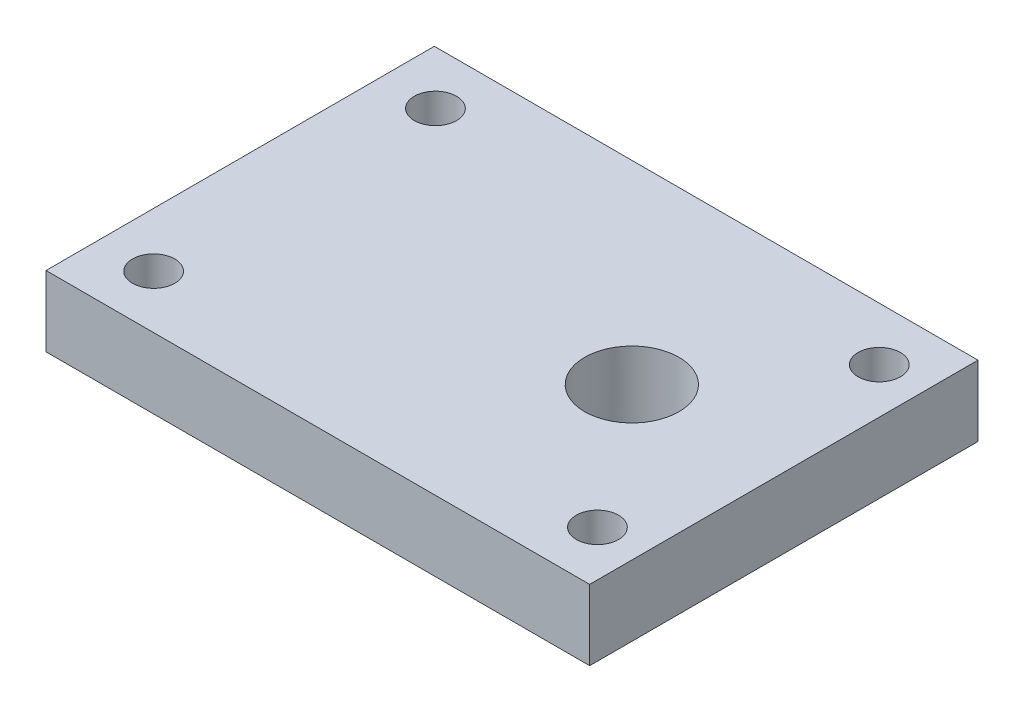
ISO-10303-21;
HEADER;
FILE_DESCRIPTION(('STEP AP214'),'2;1');
FILE_NAME('part.step','',(''),(''),'','','');
FILE_SCHEMA(('AUTOMOTIVE_DESIGN { 1 0 10303 214 1 1 1 1 }'));
ENDSEC;
DATA;
#1=APPLICATION_CONTEXT('core data for automotive mechanical design processes');
#2=APPLICATION_PROTOCOL_DEFINITION('international standard','automotive_design',2000,#1);
#3=PRODUCT_CONTEXT('',#1,'mechanical');
#4=PRODUCT('Part','Part','',(#3));
#5=PRODUCT_RELATED_PRODUCT_CATEGORY('part','',(#4));
#6=PRODUCT_DEFINITION_FORMATION('','',#4);
#7=PRODUCT_DEFINITION_CONTEXT('part definition',#1,'design');
#8=PRODUCT_DEFINITION('design','',#6,#7);
#9=PRODUCT_DEFINITION_SHAPE('','',#8);
#10=(LENGTH_UNIT() NAMED_UNIT(*) SI_UNIT(.MILLI.,.METRE.));
#11=(NAMED_UNIT(*) PLANE_ANGLE_UNIT() SI_UNIT($,.RADIAN.));
#12=(NAMED_UNIT(*) SI_UNIT($,.STERADIAN.) SOLID_ANGLE_UNIT());
#13=UNCERTAINTY_MEASURE_WITH_UNIT(LENGTH_MEASURE(1.E-05),#10,'distance_accuracy_value','');
#14=(GEOMETRIC_REPRESENTATION_CONTEXT(3) GLOBAL_UNCERTAINTY_ASSIGNED_CONTEXT((#13)) GLOBAL_UNIT_ASSIGNED_CONTEXT((#10,
#11,#12)) REPRESENTATION_CONTEXT('',''));
#15=CARTESIAN_POINT('',(0.,0.,0.));
#16=DIRECTION('',(0.,0.,1.));
#17=DIRECTION('',(1.,0.,0.));
#18=AXIS2_PLACEMENT_3D('',#15,#16,#17);
#19=CARTESIAN_POINT('',(0.,6.35,0.));
#20=DIRECTION('',(0.,-1.,0.));
#21=DIRECTION('',(0.,0.,-1.));
#22=AXIS2_PLACEMENT_3D('',#19,#20,#21);
#23=PLANE('',#22);
#24=CARTESIAN_POINT('',(10.8,6.35,0.));
#25=DIRECTION('',(0.,1.,0.));
#26=DIRECTION('',(0.,0.,1.));
#27=AXIS2_PLACEMENT_3D('',#24,#25,#26);
#28=CIRCLE('',#27,4.25);
#29=CARTESIAN_POINT('',(10.8,6.35,4.25));
#30=VERTEX_POINT('',#29);
#31=EDGE_CURVE('E168',#30,#30,#28,.T.);
#32=ORIENTED_EDGE('',*,*,#31,.F.);
#33=EDGE_LOOP('',(#32));
#34=FACE_BOUND('',#33,.T.);
#35=DIRECTION('',(0.,0.,-1.));
#36=VECTOR('',#35,1.);
#37=CARTESIAN_POINT('',(24.5,6.35,17.5));
#38=LINE('',#37,#36);
#39=CARTESIAN_POINT('',(24.5,6.35,17.5));
#40=VERTEX_POINT('',#39);
#41=CARTESIAN_POINT('',(24.5,6.35,-17.5));
#42=VERTEX_POINT('',#41);
#43=EDGE_CURVE('E95',#40,#42,#38,.T.);
#44=ORIENTED_EDGE('',*,*,#43,.T.);
#45=DIRECTION('',(-1.,0.,0.));
#46=VECTOR('',#45,1.);
#47=CARTESIAN_POINT('',(-24.5,6.35,-17.5));
#48=LINE('',#47,#46);
#49=CARTESIAN_POINT('',(-24.5,6.35,-17.5));
#50=VERTEX_POINT('',#49);
#51=EDGE_CURVE('E90',#42,#50,#48,.T.);
#52=ORIENTED_EDGE('',*,*,#51,.T.);
#53=DIRECTION('',(0.,0.,1.));
#54=VECTOR('',#53,1.);
#55=CARTESIAN_POINT('',(-24.5,6.35,17.5));
#56=LINE('',#55,#54);
#57=CARTESIAN_POINT('',(-24.5,6.35,17.5));
#58=VERTEX_POINT('',#57);
#59=EDGE_CURVE('E93',#50,#58,#56,.T.);
#60=ORIENTED_EDGE('',*,*,#59,.T.);
#61=DIRECTION('',(1.,0.,0.));
#62=VECTOR('',#61,1.);
#63=CARTESIAN_POINT('',(-24.5,6.35,17.5));
#64=LINE('',#63,#62);
#65=EDGE_CURVE('E60',#58,#40,#64,.T.);
#66=ORIENTED_EDGE('',*,*,#65,.T.);
#67=EDGE_LOOP('',(#44,#52,#60,#66));
#68=FACE_BOUND('',#67,.T.);
#69=CARTESIAN_POINT('',(-19.6,6.35,-12.7));
#70=DIRECTION('',(0.,1.,0.));
#71=DIRECTION('',(0.,0.,1.));
#72=AXIS2_PLACEMENT_3D('',#69,#70,#71);
#73=CIRCLE('',#72,1.90500000000001);
#74=CARTESIAN_POINT('',(-19.6,6.35,-10.795));
#75=VERTEX_POINT('',#74);
#76=EDGE_CURVE('E115',#75,#75,#73,.T.);
#77=ORIENTED_EDGE('',*,*,#76,.F.);
#78=EDGE_LOOP('',(#77));
#79=FACE_BOUND('',#78,.T.);
#80=CARTESIAN_POINT('',(20.4,6.35,-12.7));
#81=DIRECTION('',(0.,1.,0.));
#82=DIRECTION('',(0.,0.,1.));
#83=AXIS2_PLACEMENT_3D('',#80,#81,#82);
#84=CIRCLE('',#83,1.905);
#85=CARTESIAN_POINT('',(20.4,6.35,-10.795));
#86=VERTEX_POINT('',#85);
#87=EDGE_CURVE('E137',#86,#86,#84,.T.);
#88=ORIENTED_EDGE('',*,*,#87,.F.);
#89=EDGE_LOOP('',(#88));
#90=FACE_BOUND('',#89,.T.);
#91=CARTESIAN_POINT('',(20.4,6.35,12.7));
#92=DIRECTION('',(0.,1.,0.));
#93=DIRECTION('',(0.,0.,1.));
#94=AXIS2_PLACEMENT_3D('',#91,#92,#93);
#95=CIRCLE('',#94,1.905);
#96=CARTESIAN_POINT('',(20.4,6.35,14.605));
#97=VERTEX_POINT('',#96);
#98=EDGE_CURVE('E145',#97,#97,#95,.T.);
#99=ORIENTED_EDGE('',*,*,#98,.F.);
#100=EDGE_LOOP('',(#99));
#101=FACE_BOUND('',#100,.T.);
#102=CARTESIAN_POINT('',(-19.6,6.35,12.7));
#103=DIRECTION('',(0.,1.,0.));
#104=DIRECTION('',(0.,0.,1.));
#105=AXIS2_PLACEMENT_3D('',#102,#103,#104);
#106=CIRCLE('',#105,1.905);
#107=CARTESIAN_POINT('',(-19.6,6.35,14.605));
#108=VERTEX_POINT('',#107);
#109=EDGE_CURVE('E153',#108,#108,#106,.T.);
#110=ORIENTED_EDGE('',*,*,#109,.F.);
#111=EDGE_LOOP('',(#110));
#112=FACE_BOUND('',#111,.T.);
#113=ADVANCED_FACE('F42',(#34,#68,#79,#90,#101,#112),#23,.F.);
#114=CARTESIAN_POINT('',(0.,0.,0.));
#115=DIRECTION('',(0.,-1.,0.));
#116=DIRECTION('',(0.,0.,-1.));
#117=AXIS2_PLACEMENT_3D('',#114,#115,#116);
#118=PLANE('',#117);
#119=CARTESIAN_POINT('',(10.8,0.,0.));
#120=DIRECTION('',(0.,-1.,0.));
#121=DIRECTION('',(0.,0.,-1.));
#122=AXIS2_PLACEMENT_3D('',#119,#120,#121);
#123=CIRCLE('',#122,4.25);
#124=CARTESIAN_POINT('',(10.8,0.,-4.25));
#125=VERTEX_POINT('',#124);
#126=EDGE_CURVE('E161',#125,#125,#123,.F.);
#127=ORIENTED_EDGE('',*,*,#126,.T.);
#128=EDGE_LOOP('',(#127));
#129=FACE_BOUND('',#128,.T.);
#130=CARTESIAN_POINT('',(20.4,0.,12.7));
#131=DIRECTION('',(0.,1.,0.));
#132=DIRECTION('',(0.,0.,1.));
#133=AXIS2_PLACEMENT_3D('',#130,#131,#132);
#134=CIRCLE('',#133,1.905);
#135=CARTESIAN_POINT('',(20.4,0.,14.605));
#136=VERTEX_POINT('',#135);
#137=EDGE_CURVE('E149',#136,#136,#134,.T.);
#138=ORIENTED_EDGE('',*,*,#137,.T.);
#139=EDGE_LOOP('',(#138));
#140=FACE_BOUND('',#139,.T.);
#141=CARTESIAN_POINT('',(-19.6,0.,-12.7));
#142=DIRECTION('',(0.,1.,0.));
#143=DIRECTION('',(0.,0.,1.));
#144=AXIS2_PLACEMENT_3D('',#141,#142,#143);
#145=CIRCLE('',#144,1.90500000000001);
#146=CARTESIAN_POINT('',(-19.6,0.,-10.795));
#147=VERTEX_POINT('',#146);
#148=EDGE_CURVE('E133',#147,#147,#145,.T.);
#149=ORIENTED_EDGE('',*,*,#148,.T.);
#150=EDGE_LOOP('',(#149));
#151=FACE_BOUND('',#150,.T.);
#152=DIRECTION('',(0.,0.,-1.));
#153=VECTOR('',#152,1.);
#154=CARTESIAN_POINT('',(24.5,0.,17.5));
#155=LINE('',#154,#153);
#156=CARTESIAN_POINT('',(24.5,0.,17.5));
#157=VERTEX_POINT('',#156);
#158=CARTESIAN_POINT('',(24.5,0.,-17.5));
#159=VERTEX_POINT('',#158);
#160=EDGE_CURVE('E111',#157,#159,#155,.T.);
#161=ORIENTED_EDGE('',*,*,#160,.F.);
#162=DIRECTION('',(1.,0.,0.));
#163=VECTOR('',#162,1.);
#164=CARTESIAN_POINT('',(-24.5,0.,17.5));
#165=LINE('',#164,#163);
#166=CARTESIAN_POINT('',(-24.5,0.,17.5));
#167=VERTEX_POINT('',#166);
#168=EDGE_CURVE('E83',#167,#157,#165,.T.);
#169=ORIENTED_EDGE('',*,*,#168,.F.);
#170=DIRECTION('',(0.,0.,1.));
#171=VECTOR('',#170,1.);
#172=CARTESIAN_POINT('',(-24.5,0.,17.5));
#173=LINE('',#172,#171);
#174=CARTESIAN_POINT('',(-24.5,0.,-17.5));
#175=VERTEX_POINT('',#174);
#176=EDGE_CURVE('E77',#175,#167,#173,.T.);
#177=ORIENTED_EDGE('',*,*,#176,.F.);
#178=DIRECTION('',(-1.,0.,0.));
#179=VECTOR('',#178,1.);
#180=CARTESIAN_POINT('',(-24.5,0.,-17.5));
#181=LINE('',#180,#179);
#182=EDGE_CURVE('E100',#159,#175,#181,.T.);
#183=ORIENTED_EDGE('',*,*,#182,.F.);
#184=EDGE_LOOP('',(#161,#169,#177,#183));
#185=FACE_BOUND('',#184,.T.);
#186=CARTESIAN_POINT('',(20.4,0.,-12.7));
#187=DIRECTION('',(0.,1.,0.));
#188=DIRECTION('',(0.,0.,1.));
#189=AXIS2_PLACEMENT_3D('',#186,#187,#188);
#190=CIRCLE('',#189,1.905);
#191=CARTESIAN_POINT('',(20.4,0.,-10.795));
#192=VERTEX_POINT('',#191);
#193=EDGE_CURVE('E141',#192,#192,#190,.T.);
#194=ORIENTED_EDGE('',*,*,#193,.T.);
#195=EDGE_LOOP('',(#194));
#196=FACE_BOUND('',#195,.T.);
#197=CARTESIAN_POINT('',(-19.6,0.,12.7));
#198=DIRECTION('',(0.,1.,0.));
#199=DIRECTION('',(0.,0.,1.));
#200=AXIS2_PLACEMENT_3D('',#197,#198,#199);
#201=CIRCLE('',#200,1.905);
#202=CARTESIAN_POINT('',(-19.6,0.,14.605));
#203=VERTEX_POINT('',#202);
#204=EDGE_CURVE('E157',#203,#203,#201,.T.);
#205=ORIENTED_EDGE('',*,*,#204,.T.);
#206=EDGE_LOOP('',(#205));
#207=FACE_BOUND('',#206,.T.);
#208=ADVANCED_FACE('F128',(#129,#140,#151,#185,#196,#207),#118,.T.);
#209=CARTESIAN_POINT('',(24.5,6.35,17.5));
#210=DIRECTION('',(-1.,0.,0.));
#211=DIRECTION('',(0.,0.,1.));
#212=AXIS2_PLACEMENT_3D('',#209,#210,#211);
#213=PLANE('',#212);
#214=ORIENTED_EDGE('',*,*,#160,.T.);
#215=DIRECTION('',(0.,-1.,0.));
#216=VECTOR('',#215,1.);
#217=CARTESIAN_POINT('',(24.5,6.35,-17.5));
#218=LINE('',#217,#216);
#219=EDGE_CURVE('E11',#42,#159,#218,.T.);
#220=ORIENTED_EDGE('',*,*,#219,.F.);
#221=ORIENTED_EDGE('',*,*,#43,.F.);
#222=DIRECTION('',(0.,-1.,0.));
#223=VECTOR('',#222,1.);
#224=CARTESIAN_POINT('',(24.5,6.35,17.5));
#225=LINE('',#224,#223);
#226=EDGE_CURVE('E107',#40,#157,#225,.T.);
#227=ORIENTED_EDGE('',*,*,#226,.T.);
#228=EDGE_LOOP('',(#214,#220,#221,#227));
#229=FACE_BOUND('',#228,.T.);
#230=ADVANCED_FACE('F44',(#229),#213,.F.);
#231=CARTESIAN_POINT('',(-24.5,6.35,-17.5));
#232=DIRECTION('',(0.,0.,1.));
#233=DIRECTION('',(1.,0.,0.));
#234=AXIS2_PLACEMENT_3D('',#231,#232,#233);
#235=PLANE('',#234);
#236=ORIENTED_EDGE('',*,*,#182,.T.);
#237=DIRECTION('',(0.,-1.,0.));
#238=VECTOR('',#237,1.);
#239=CARTESIAN_POINT('',(-24.5,6.35,-17.5));
#240=LINE('',#239,#238);
#241=EDGE_CURVE('E52',#50,#175,#240,.T.);
#242=ORIENTED_EDGE('',*,*,#241,.F.);
#243=ORIENTED_EDGE('',*,*,#51,.F.);
#244=ORIENTED_EDGE('',*,*,#219,.T.);
#245=EDGE_LOOP('',(#236,#242,#243,#244));
#246=FACE_BOUND('',#245,.T.);
#247=ADVANCED_FACE('F99',(#246),#235,.F.);
#248=CARTESIAN_POINT('',(-24.5,6.35,17.5));
#249=DIRECTION('',(1.,0.,0.));
#250=DIRECTION('',(0.,0.,-1.));
#251=AXIS2_PLACEMENT_3D('',#248,#249,#250);
#252=PLANE('',#251);
#253=ORIENTED_EDGE('',*,*,#176,.T.);
#254=DIRECTION('',(0.,-1.,0.));
#255=VECTOR('',#254,1.);
#256=CARTESIAN_POINT('',(-24.5,6.35,17.5));
#257=LINE('',#256,#255);
#258=EDGE_CURVE('E102',#58,#167,#257,.T.);
#259=ORIENTED_EDGE('',*,*,#258,.F.);
#260=ORIENTED_EDGE('',*,*,#59,.F.);
#261=ORIENTED_EDGE('',*,*,#241,.T.);
#262=EDGE_LOOP('',(#253,#259,#260,#261));
#263=FACE_BOUND('',#262,.T.);
#264=ADVANCED_FACE('F103',(#263),#252,.F.);
#265=CARTESIAN_POINT('',(-24.5,6.35,17.5));
#266=DIRECTION('',(0.,0.,-1.));
#267=DIRECTION('',(-1.,0.,0.));
#268=AXIS2_PLACEMENT_3D('',#265,#266,#267);
#269=PLANE('',#268);
#270=ORIENTED_EDGE('',*,*,#168,.T.);
#271=ORIENTED_EDGE('',*,*,#226,.F.);
#272=ORIENTED_EDGE('',*,*,#65,.F.);
#273=ORIENTED_EDGE('',*,*,#258,.T.);
#274=EDGE_LOOP('',(#270,#271,#272,#273));
#275=FACE_BOUND('',#274,.T.);
#276=ADVANCED_FACE('F125',(#275),#269,.F.);
#277=CARTESIAN_POINT('',(-19.6,6.35,-12.7));
#278=DIRECTION('',(0.,-1.,0.));
#279=DIRECTION('',(0.,0.,-1.));
#280=AXIS2_PLACEMENT_3D('',#277,#278,#279);
#281=CYLINDRICAL_SURFACE('',#280,1.90500000000001);
#282=ORIENTED_EDGE('',*,*,#76,.T.);
#283=EDGE_LOOP('',(#282));
#284=FACE_BOUND('',#283,.T.);
#285=ORIENTED_EDGE('',*,*,#148,.F.);
#286=EDGE_LOOP('',(#285));
#287=FACE_BOUND('',#286,.T.);
#288=ADVANCED_FACE('F185',(#284,#287),#281,.F.);
#289=CARTESIAN_POINT('',(20.4,6.35,-12.7));
#290=DIRECTION('',(0.,-1.,0.));
#291=DIRECTION('',(0.,0.,-1.));
#292=AXIS2_PLACEMENT_3D('',#289,#290,#291);
#293=CYLINDRICAL_SURFACE('',#292,1.905);
#294=ORIENTED_EDGE('',*,*,#87,.T.);
#295=EDGE_LOOP('',(#294));
#296=FACE_BOUND('',#295,.T.);
#297=ORIENTED_EDGE('',*,*,#193,.F.);
#298=EDGE_LOOP('',(#297));
#299=FACE_BOUND('',#298,.T.);
#300=ADVANCED_FACE('F240',(#296,#299),#293,.F.);
#301=CARTESIAN_POINT('',(20.4,6.35,12.7));
#302=DIRECTION('',(0.,-1.,0.));
#303=DIRECTION('',(0.,0.,-1.));
#304=AXIS2_PLACEMENT_3D('',#301,#302,#303);
#305=CYLINDRICAL_SURFACE('',#304,1.905);
#306=ORIENTED_EDGE('',*,*,#98,.T.);
#307=EDGE_LOOP('',(#306));
#308=FACE_BOUND('',#307,.T.);
#309=ORIENTED_EDGE('',*,*,#137,.F.);
#310=EDGE_LOOP('',(#309));
#311=FACE_BOUND('',#310,.T.);
#312=ADVANCED_FACE('F249',(#308,#311),#305,.F.);
#313=CARTESIAN_POINT('',(-19.6,6.35,12.7));
#314=DIRECTION('',(0.,-1.,0.));
#315=DIRECTION('',(0.,0.,-1.));
#316=AXIS2_PLACEMENT_3D('',#313,#314,#315);
#317=CYLINDRICAL_SURFACE('',#316,1.905);
#318=ORIENTED_EDGE('',*,*,#109,.T.);
#319=EDGE_LOOP('',(#318));
#320=FACE_BOUND('',#319,.T.);
#321=ORIENTED_EDGE('',*,*,#204,.F.);
#322=EDGE_LOOP('',(#321));
#323=FACE_BOUND('',#322,.T.);
#324=ADVANCED_FACE('F258',(#320,#323),#317,.F.);
#325=CARTESIAN_POINT('',(10.8,-12.0208152801713,0.));
#326=DIRECTION('',(0.,1.,0.));
#327=DIRECTION('',(0.,0.,1.));
#328=AXIS2_PLACEMENT_3D('',#325,#326,#327);
#329=CYLINDRICAL_SURFACE('',#328,4.25);
#330=ORIENTED_EDGE('',*,*,#31,.T.);
#331=EDGE_LOOP('',(#330));
#332=FACE_BOUND('',#331,.T.);
#333=ORIENTED_EDGE('',*,*,#126,.F.);
#334=EDGE_LOOP('',(#333));
#335=FACE_BOUND('',#334,.T.);
#336=ADVANCED_FACE('F173',(#332,#335),#329,.F.);
#337=CLOSED_SHELL('',(#113,#208,#230,#247,#264,#276,#288,#300,#312,#324,#336));
#338=MANIFOLD_SOLID_BREP('B2',#337);
#339=ADVANCED_BREP_SHAPE_REPRESENTATION('',(#18,#338),#14);
#340=SHAPE_DEFINITION_REPRESENTATION(#9,#339);
ENDSEC;
END-ISO-10303-21;
